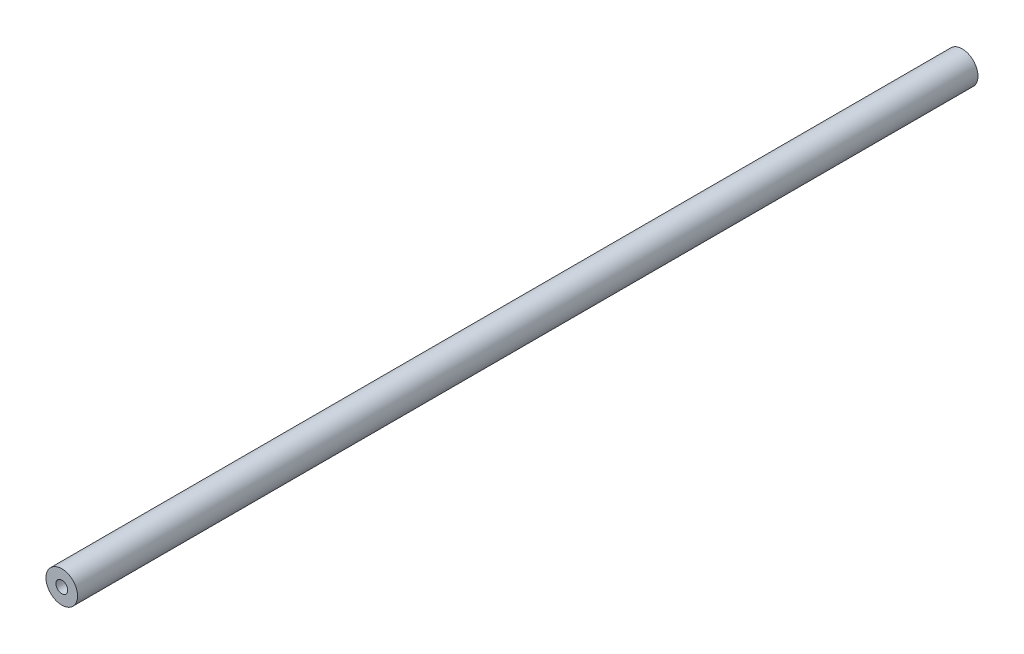
ISO-10303-21;
HEADER;
FILE_DESCRIPTION(('STEP AP214'),'2;1');
FILE_NAME('part.step','',(''),(''),'','','');
FILE_SCHEMA(('AUTOMOTIVE_DESIGN { 1 0 10303 214 1 1 1 1 }'));
ENDSEC;
DATA;
#1=APPLICATION_CONTEXT('core data for automotive mechanical design processes');
#2=APPLICATION_PROTOCOL_DEFINITION('international standard','automotive_design',2000,#1);
#3=PRODUCT_CONTEXT('',#1,'mechanical');
#4=PRODUCT('Part','Part','',(#3));
#5=PRODUCT_RELATED_PRODUCT_CATEGORY('part','',(#4));
#6=PRODUCT_DEFINITION_FORMATION('','',#4);
#7=PRODUCT_DEFINITION_CONTEXT('part definition',#1,'design');
#8=PRODUCT_DEFINITION('design','',#6,#7);
#9=PRODUCT_DEFINITION_SHAPE('','',#8);
#10=(LENGTH_UNIT() NAMED_UNIT(*) SI_UNIT(.MILLI.,.METRE.));
#11=(NAMED_UNIT(*) PLANE_ANGLE_UNIT() SI_UNIT($,.RADIAN.));
#12=(NAMED_UNIT(*) SI_UNIT($,.STERADIAN.) SOLID_ANGLE_UNIT());
#13=UNCERTAINTY_MEASURE_WITH_UNIT(LENGTH_MEASURE(1.E-05),#10,'distance_accuracy_value','');
#14=(GEOMETRIC_REPRESENTATION_CONTEXT(3) GLOBAL_UNCERTAINTY_ASSIGNED_CONTEXT((#13)) GLOBAL_UNIT_ASSIGNED_CONTEXT((#10,
#11,#12)) REPRESENTATION_CONTEXT('',''));
#15=CARTESIAN_POINT('',(0.,0.,0.));
#16=DIRECTION('',(0.,0.,1.));
#17=DIRECTION('',(1.,0.,0.));
#18=AXIS2_PLACEMENT_3D('',#15,#16,#17);
#19=CARTESIAN_POINT('',(0.,0.,723.9));
#20=DIRECTION('',(0.,0.,1.));
#21=DIRECTION('',(1.,0.,0.));
#22=AXIS2_PLACEMENT_3D('',#19,#20,#21);
#23=PLANE('',#22);
#24=CARTESIAN_POINT('',(0.,0.,723.9));
#25=DIRECTION('',(0.,0.,1.));
#26=DIRECTION('',(1.,0.,0.));
#27=AXIS2_PLACEMENT_3D('',#24,#25,#26);
#28=CIRCLE('',#27,12.7);
#29=CARTESIAN_POINT('',(12.7,0.,723.9));
#30=VERTEX_POINT('',#29);
#31=EDGE_CURVE('E12',#30,#30,#28,.T.);
#32=ORIENTED_EDGE('',*,*,#31,.T.);
#33=EDGE_LOOP('',(#32));
#34=FACE_BOUND('',#33,.T.);
#35=CARTESIAN_POINT('',(0.,0.,723.9));
#36=DIRECTION('',(0.,0.,1.));
#37=DIRECTION('',(1.,0.,0.));
#38=AXIS2_PLACEMENT_3D('',#35,#36,#37);
#39=CIRCLE('',#38,4.7625);
#40=CARTESIAN_POINT('',(4.7625,0.,723.9));
#41=VERTEX_POINT('',#40);
#42=EDGE_CURVE('E55',#41,#41,#39,.T.);
#43=ORIENTED_EDGE('',*,*,#42,.F.);
#44=EDGE_LOOP('',(#43));
#45=FACE_BOUND('',#44,.T.);
#46=ADVANCED_FACE('F44',(#34,#45),#23,.T.);
#47=CARTESIAN_POINT('',(0.,0.,0.));
#48=DIRECTION('',(0.,0.,1.));
#49=DIRECTION('',(1.,0.,0.));
#50=AXIS2_PLACEMENT_3D('',#47,#48,#49);
#51=PLANE('',#50);
#52=CARTESIAN_POINT('',(0.,0.,0.));
#53=DIRECTION('',(0.,0.,1.));
#54=DIRECTION('',(1.,0.,0.));
#55=AXIS2_PLACEMENT_3D('',#52,#53,#54);
#56=CIRCLE('',#55,12.7);
#57=CARTESIAN_POINT('',(12.7,0.,0.));
#58=VERTEX_POINT('',#57);
#59=EDGE_CURVE('E48',#58,#58,#56,.T.);
#60=ORIENTED_EDGE('',*,*,#59,.F.);
#61=EDGE_LOOP('',(#60));
#62=FACE_BOUND('',#61,.T.);
#63=CARTESIAN_POINT('',(0.,0.,0.));
#64=DIRECTION('',(0.,0.,1.));
#65=DIRECTION('',(1.,0.,0.));
#66=AXIS2_PLACEMENT_3D('',#63,#64,#65);
#67=CIRCLE('',#66,4.7625);
#68=CARTESIAN_POINT('',(4.7625,0.,0.));
#69=VERTEX_POINT('',#68);
#70=EDGE_CURVE('E57',#69,#69,#67,.T.);
#71=ORIENTED_EDGE('',*,*,#70,.T.);
#72=EDGE_LOOP('',(#71));
#73=FACE_BOUND('',#72,.T.);
#74=ADVANCED_FACE('F67',(#62,#73),#51,.F.);
#75=CARTESIAN_POINT('',(0.,0.,723.9));
#76=DIRECTION('',(0.,0.,-1.));
#77=DIRECTION('',(-1.,0.,0.));
#78=AXIS2_PLACEMENT_3D('',#75,#76,#77);
#79=CYLINDRICAL_SURFACE('',#78,12.7);
#80=ORIENTED_EDGE('',*,*,#31,.F.);
#81=EDGE_LOOP('',(#80));
#82=FACE_BOUND('',#81,.T.);
#83=ORIENTED_EDGE('',*,*,#59,.T.);
#84=EDGE_LOOP('',(#83));
#85=FACE_BOUND('',#84,.T.);
#86=ADVANCED_FACE('F46',(#82,#85),#79,.T.);
#87=CARTESIAN_POINT('',(0.,0.,723.9));
#88=DIRECTION('',(0.,0.,-1.));
#89=DIRECTION('',(-1.,0.,0.));
#90=AXIS2_PLACEMENT_3D('',#87,#88,#89);
#91=CYLINDRICAL_SURFACE('',#90,4.7625);
#92=ORIENTED_EDGE('',*,*,#42,.T.);
#93=EDGE_LOOP('',(#92));
#94=FACE_BOUND('',#93,.T.);
#95=ORIENTED_EDGE('',*,*,#70,.F.);
#96=EDGE_LOOP('',(#95));
#97=FACE_BOUND('',#96,.T.);
#98=ADVANCED_FACE('F63',(#94,#97),#91,.F.);
#99=CLOSED_SHELL('',(#46,#74,#86,#98));
#100=MANIFOLD_SOLID_BREP('B2',#99);
#101=ADVANCED_BREP_SHAPE_REPRESENTATION('',(#18,#100),#14);
#102=SHAPE_DEFINITION_REPRESENTATION(#9,#101);
ENDSEC;
END-ISO-10303-21;
